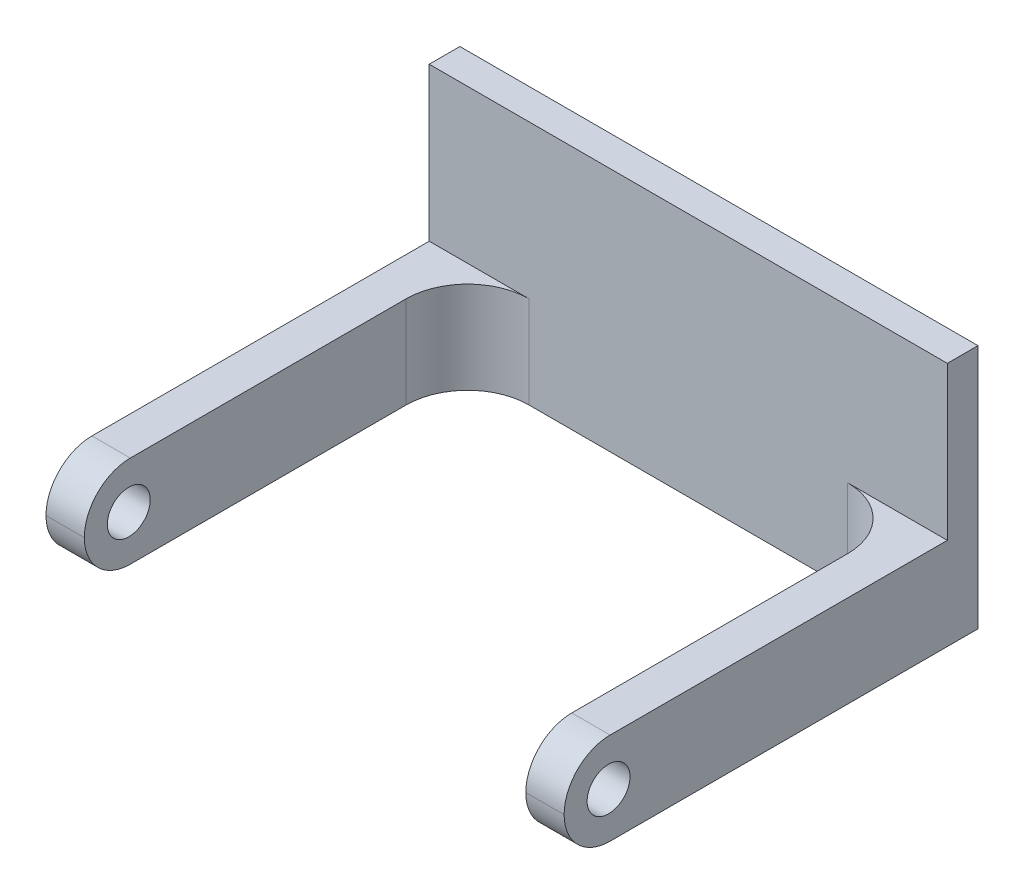
ISO-10303-21;
HEADER;
FILE_DESCRIPTION(('STEP AP214'),'2;1');
FILE_NAME('part.step','',(''),(''),'','','');
FILE_SCHEMA(('AUTOMOTIVE_DESIGN { 1 0 10303 214 1 1 1 1 }'));
ENDSEC;
DATA;
#1=APPLICATION_CONTEXT('core data for automotive mechanical design processes');
#2=APPLICATION_PROTOCOL_DEFINITION('international standard','automotive_design',2000,#1);
#3=PRODUCT_CONTEXT('',#1,'mechanical');
#4=PRODUCT('Part','Part','',(#3));
#5=PRODUCT_RELATED_PRODUCT_CATEGORY('part','',(#4));
#6=PRODUCT_DEFINITION_FORMATION('','',#4);
#7=PRODUCT_DEFINITION_CONTEXT('part definition',#1,'design');
#8=PRODUCT_DEFINITION('design','',#6,#7);
#9=PRODUCT_DEFINITION_SHAPE('','',#8);
#10=(LENGTH_UNIT() NAMED_UNIT(*) SI_UNIT(.MILLI.,.METRE.));
#11=(NAMED_UNIT(*) PLANE_ANGLE_UNIT() SI_UNIT($,.RADIAN.));
#12=(NAMED_UNIT(*) SI_UNIT($,.STERADIAN.) SOLID_ANGLE_UNIT());
#13=UNCERTAINTY_MEASURE_WITH_UNIT(LENGTH_MEASURE(1.E-05),#10,'distance_accuracy_value','');
#14=(GEOMETRIC_REPRESENTATION_CONTEXT(3) GLOBAL_UNCERTAINTY_ASSIGNED_CONTEXT((#13)) GLOBAL_UNIT_ASSIGNED_CONTEXT((#10,
#11,#12)) REPRESENTATION_CONTEXT('',''));
#15=CARTESIAN_POINT('',(0.,0.,0.));
#16=DIRECTION('',(0.,0.,1.));
#17=DIRECTION('',(1.,0.,0.));
#18=AXIS2_PLACEMENT_3D('',#15,#16,#17);
#19=CARTESIAN_POINT('',(-16.9,3.,2.));
#20=DIRECTION('',(0.,-1.,0.));
#21=DIRECTION('',(0.,0.,-1.));
#22=AXIS2_PLACEMENT_3D('',#19,#20,#21);
#23=PLANE('',#22);
#24=DIRECTION('',(1.,0.,0.));
#25=VECTOR('',#24,1.);
#26=CARTESIAN_POINT('',(-16.9,3.,2.));
#27=LINE('',#26,#25);
#28=CARTESIAN_POINT('',(-16.9,3.,2.));
#29=VERTEX_POINT('',#28);
#30=CARTESIAN_POINT('',(-10.4,3.,2.));
#31=VERTEX_POINT('',#30);
#32=EDGE_CURVE('E159',#29,#31,#27,.T.);
#33=ORIENTED_EDGE('',*,*,#32,.F.);
#34=DIRECTION('',(0.,0.,-1.));
#35=VECTOR('',#34,1.);
#36=CARTESIAN_POINT('',(-16.9,3.,2.));
#37=LINE('',#36,#35);
#38=CARTESIAN_POINT('',(-16.9,3.,24.));
#39=VERTEX_POINT('',#38);
#40=EDGE_CURVE('E165',#39,#29,#37,.T.);
#41=ORIENTED_EDGE('',*,*,#40,.F.);
#42=DIRECTION('',(-1.,0.,0.));
#43=VECTOR('',#42,1.);
#44=CARTESIAN_POINT('',(-14.4,3.,24.));
#45=LINE('',#44,#43);
#46=CARTESIAN_POINT('',(-14.4,3.,24.));
#47=VERTEX_POINT('',#46);
#48=EDGE_CURVE('E239',#39,#47,#45,.F.);
#49=ORIENTED_EDGE('',*,*,#48,.T.);
#50=DIRECTION('',(0.,0.,-1.));
#51=VECTOR('',#50,1.);
#52=CARTESIAN_POINT('',(-14.4,3.,27.));
#53=LINE('',#52,#51);
#54=CARTESIAN_POINT('',(-14.4,3.,6.));
#55=VERTEX_POINT('',#54);
#56=EDGE_CURVE('E210',#47,#55,#53,.T.);
#57=ORIENTED_EDGE('',*,*,#56,.T.);
#58=CARTESIAN_POINT('',(-10.4,3.,6.));
#59=DIRECTION('',(0.,-1.,0.));
#60=DIRECTION('',(0.,0.,-1.));
#61=AXIS2_PLACEMENT_3D('',#58,#59,#60);
#62=CIRCLE('',#61,4.);
#63=EDGE_CURVE('E43',#55,#31,#62,.T.);
#64=ORIENTED_EDGE('',*,*,#63,.T.);
#65=EDGE_LOOP('',(#33,#41,#49,#57,#64));
#66=FACE_BOUND('',#65,.T.);
#67=ADVANCED_FACE('F35',(#66),#23,.F.);
#68=CARTESIAN_POINT('',(10.4,3.,2.));
#69=VERTEX_POINT('',#68);
#70=CARTESIAN_POINT('',(16.9,3.,2.));
#71=VERTEX_POINT('',#70);
#72=EDGE_CURVE('E175',#69,#71,#27,.T.);
#73=ORIENTED_EDGE('',*,*,#72,.F.);
#74=CARTESIAN_POINT('',(10.4,3.,6.));
#75=DIRECTION('',(0.,-1.,0.));
#76=DIRECTION('',(0.,0.,-1.));
#77=AXIS2_PLACEMENT_3D('',#74,#75,#76);
#78=CIRCLE('',#77,4.);
#79=CARTESIAN_POINT('',(14.4,3.,6.));
#80=VERTEX_POINT('',#79);
#81=EDGE_CURVE('E324',#69,#80,#78,.T.);
#82=ORIENTED_EDGE('',*,*,#81,.T.);
#83=DIRECTION('',(0.,0.,-1.));
#84=VECTOR('',#83,1.);
#85=CARTESIAN_POINT('',(14.4,3.,27.));
#86=LINE('',#85,#84);
#87=CARTESIAN_POINT('',(14.4,3.,24.));
#88=VERTEX_POINT('',#87);
#89=EDGE_CURVE('E213',#88,#80,#86,.T.);
#90=ORIENTED_EDGE('',*,*,#89,.F.);
#91=DIRECTION('',(-1.,0.,0.));
#92=VECTOR('',#91,1.);
#93=CARTESIAN_POINT('',(-16.9,3.,24.));
#94=LINE('',#93,#92);
#95=CARTESIAN_POINT('',(16.9,3.,24.));
#96=VERTEX_POINT('',#95);
#97=EDGE_CURVE('E237',#88,#96,#94,.F.);
#98=ORIENTED_EDGE('',*,*,#97,.T.);
#99=DIRECTION('',(0.,0.,-1.));
#100=VECTOR('',#99,1.);
#101=CARTESIAN_POINT('',(16.9,3.,2.));
#102=LINE('',#101,#100);
#103=EDGE_CURVE('E202',#96,#71,#102,.T.);
#104=ORIENTED_EDGE('',*,*,#103,.T.);
#105=EDGE_LOOP('',(#73,#82,#90,#98,#104));
#106=FACE_BOUND('',#105,.T.);
#107=ADVANCED_FACE('F286',(#106),#23,.F.);
#108=CARTESIAN_POINT('',(0.,0.,2.));
#109=DIRECTION('',(0.,0.,-1.));
#110=DIRECTION('',(-1.,0.,0.));
#111=AXIS2_PLACEMENT_3D('',#108,#109,#110);
#112=PLANE('',#111);
#113=DIRECTION('',(1.,0.,0.));
#114=VECTOR('',#113,1.);
#115=CARTESIAN_POINT('',(-16.9,-3.,2.));
#116=LINE('',#115,#114);
#117=CARTESIAN_POINT('',(-10.4,-3.,2.));
#118=VERTEX_POINT('',#117);
#119=CARTESIAN_POINT('',(10.4,-3.,2.));
#120=VERTEX_POINT('',#119);
#121=EDGE_CURVE('E191',#118,#120,#116,.T.);
#122=ORIENTED_EDGE('',*,*,#121,.T.);
#123=DIRECTION('',(0.,-1.,0.));
#124=VECTOR('',#123,1.);
#125=CARTESIAN_POINT('',(10.4,3.,2.));
#126=LINE('',#125,#124);
#127=EDGE_CURVE('E326',#120,#69,#126,.F.);
#128=ORIENTED_EDGE('',*,*,#127,.T.);
#129=ORIENTED_EDGE('',*,*,#72,.T.);
#130=DIRECTION('',(0.,-1.,0.));
#131=VECTOR('',#130,1.);
#132=CARTESIAN_POINT('',(16.9,13.,2.));
#133=LINE('',#132,#131);
#134=CARTESIAN_POINT('',(16.9,13.,2.));
#135=VERTEX_POINT('',#134);
#136=EDGE_CURVE('E145',#135,#71,#133,.T.);
#137=ORIENTED_EDGE('',*,*,#136,.F.);
#138=DIRECTION('',(1.,0.,0.));
#139=VECTOR('',#138,1.);
#140=CARTESIAN_POINT('',(-16.9,13.,2.));
#141=LINE('',#140,#139);
#142=CARTESIAN_POINT('',(-16.9,13.,2.));
#143=VERTEX_POINT('',#142);
#144=EDGE_CURVE('E137',#143,#135,#141,.T.);
#145=ORIENTED_EDGE('',*,*,#144,.F.);
#146=DIRECTION('',(0.,-1.,0.));
#147=VECTOR('',#146,1.);
#148=CARTESIAN_POINT('',(-16.9,13.,2.));
#149=LINE('',#148,#147);
#150=EDGE_CURVE('E142',#143,#29,#149,.T.);
#151=ORIENTED_EDGE('',*,*,#150,.T.);
#152=ORIENTED_EDGE('',*,*,#32,.T.);
#153=DIRECTION('',(0.,1.,0.));
#154=VECTOR('',#153,1.);
#155=CARTESIAN_POINT('',(-10.4,-3.,2.));
#156=LINE('',#155,#154);
#157=EDGE_CURVE('E247',#31,#118,#156,.F.);
#158=ORIENTED_EDGE('',*,*,#157,.T.);
#159=EDGE_LOOP('',(#122,#128,#129,#137,#145,#151,#152,#158));
#160=FACE_BOUND('',#159,.T.);
#161=ADVANCED_FACE('F140',(#160),#112,.F.);
#162=CARTESIAN_POINT('',(16.9,-3.,2.));
#163=DIRECTION('',(-1.,0.,0.));
#164=DIRECTION('',(0.,0.,1.));
#165=AXIS2_PLACEMENT_3D('',#162,#163,#164);
#166=PLANE('',#165);
#167=CARTESIAN_POINT('',(16.9,0.,24.1));
#168=DIRECTION('',(1.,0.,0.));
#169=DIRECTION('',(0.,0.,-1.));
#170=AXIS2_PLACEMENT_3D('',#167,#168,#169);
#171=CIRCLE('',#170,1.4);
#172=CARTESIAN_POINT('',(16.9,0.,22.7));
#173=VERTEX_POINT('',#172);
#174=EDGE_CURVE('E243',#173,#173,#171,.T.);
#175=ORIENTED_EDGE('',*,*,#174,.F.);
#176=EDGE_LOOP('',(#175));
#177=FACE_BOUND('',#176,.T.);
#178=CARTESIAN_POINT('',(16.9,0.,24.));
#179=DIRECTION('',(-1.,0.,0.));
#180=DIRECTION('',(0.,0.,1.));
#181=AXIS2_PLACEMENT_3D('',#178,#179,#180);
#182=CIRCLE('',#181,3.);
#183=CARTESIAN_POINT('',(16.9,0.,27.));
#184=VERTEX_POINT('',#183);
#185=EDGE_CURVE('E229',#96,#184,#182,.F.);
#186=ORIENTED_EDGE('',*,*,#185,.T.);
#187=CARTESIAN_POINT('',(16.9,0.,24.));
#188=DIRECTION('',(-1.,0.,0.));
#189=DIRECTION('',(0.,0.,1.));
#190=AXIS2_PLACEMENT_3D('',#187,#188,#189);
#191=CIRCLE('',#190,3.);
#192=CARTESIAN_POINT('',(16.9,-3.,24.));
#193=VERTEX_POINT('',#192);
#194=EDGE_CURVE('E231',#184,#193,#191,.F.);
#195=ORIENTED_EDGE('',*,*,#194,.T.);
#196=DIRECTION('',(0.,0.,-1.));
#197=VECTOR('',#196,1.);
#198=CARTESIAN_POINT('',(16.9,-3.,2.));
#199=LINE('',#198,#197);
#200=CARTESIAN_POINT('',(16.9,-3.,0.));
#201=VERTEX_POINT('',#200);
#202=EDGE_CURVE('E197',#193,#201,#199,.T.);
#203=ORIENTED_EDGE('',*,*,#202,.T.);
#204=DIRECTION('',(0.,1.,0.));
#205=VECTOR('',#204,1.);
#206=CARTESIAN_POINT('',(16.9,-3.,0.));
#207=LINE('',#206,#205);
#208=CARTESIAN_POINT('',(16.9,13.,0.));
#209=VERTEX_POINT('',#208);
#210=EDGE_CURVE('E186',#201,#209,#207,.T.);
#211=ORIENTED_EDGE('',*,*,#210,.T.);
#212=DIRECTION('',(0.,0.,-1.));
#213=VECTOR('',#212,1.);
#214=CARTESIAN_POINT('',(16.9,13.,0.));
#215=LINE('',#214,#213);
#216=EDGE_CURVE('E149',#135,#209,#215,.T.);
#217=ORIENTED_EDGE('',*,*,#216,.F.);
#218=ORIENTED_EDGE('',*,*,#136,.T.);
#219=ORIENTED_EDGE('',*,*,#103,.F.);
#220=EDGE_LOOP('',(#186,#195,#203,#211,#217,#218,#219));
#221=FACE_BOUND('',#220,.T.);
#222=ADVANCED_FACE('F296',(#177,#221),#166,.F.);
#223=CARTESIAN_POINT('',(-16.9,-3.,2.));
#224=DIRECTION('',(1.,0.,0.));
#225=DIRECTION('',(0.,0.,-1.));
#226=AXIS2_PLACEMENT_3D('',#223,#224,#225);
#227=PLANE('',#226);
#228=CARTESIAN_POINT('',(-16.9,0.,24.1));
#229=DIRECTION('',(1.,0.,0.));
#230=DIRECTION('',(0.,0.,-1.));
#231=AXIS2_PLACEMENT_3D('',#228,#229,#230);
#232=CIRCLE('',#231,1.4);
#233=CARTESIAN_POINT('',(-16.9,0.,22.7));
#234=VERTEX_POINT('',#233);
#235=EDGE_CURVE('E261',#234,#234,#232,.T.);
#236=ORIENTED_EDGE('',*,*,#235,.T.);
#237=EDGE_LOOP('',(#236));
#238=FACE_BOUND('',#237,.T.);
#239=DIRECTION('',(0.,0.,-1.));
#240=VECTOR('',#239,1.);
#241=CARTESIAN_POINT('',(-16.9,-3.,2.));
#242=LINE('',#241,#240);
#243=CARTESIAN_POINT('',(-16.9,-3.,24.));
#244=VERTEX_POINT('',#243);
#245=CARTESIAN_POINT('',(-16.9,-3.,0.));
#246=VERTEX_POINT('',#245);
#247=EDGE_CURVE('E199',#244,#246,#242,.T.);
#248=ORIENTED_EDGE('',*,*,#247,.F.);
#249=CARTESIAN_POINT('',(-16.9,0.,24.));
#250=DIRECTION('',(1.,0.,0.));
#251=DIRECTION('',(0.,0.,-1.));
#252=AXIS2_PLACEMENT_3D('',#249,#250,#251);
#253=CIRCLE('',#252,3.);
#254=CARTESIAN_POINT('',(-16.9,0.,27.));
#255=VERTEX_POINT('',#254);
#256=EDGE_CURVE('E227',#244,#255,#253,.F.);
#257=ORIENTED_EDGE('',*,*,#256,.T.);
#258=CARTESIAN_POINT('',(-16.9,0.,24.));
#259=DIRECTION('',(1.,0.,0.));
#260=DIRECTION('',(0.,0.,-1.));
#261=AXIS2_PLACEMENT_3D('',#258,#259,#260);
#262=CIRCLE('',#261,3.);
#263=EDGE_CURVE('E225',#255,#39,#262,.F.);
#264=ORIENTED_EDGE('',*,*,#263,.T.);
#265=ORIENTED_EDGE('',*,*,#40,.T.);
#266=ORIENTED_EDGE('',*,*,#150,.F.);
#267=DIRECTION('',(0.,0.,1.));
#268=VECTOR('',#267,1.);
#269=CARTESIAN_POINT('',(-16.9,13.,0.));
#270=LINE('',#269,#268);
#271=CARTESIAN_POINT('',(-16.9,13.,0.));
#272=VERTEX_POINT('',#271);
#273=EDGE_CURVE('E150',#272,#143,#270,.T.);
#274=ORIENTED_EDGE('',*,*,#273,.F.);
#275=DIRECTION('',(0.,-1.,0.));
#276=VECTOR('',#275,1.);
#277=CARTESIAN_POINT('',(-16.9,-3.,0.));
#278=LINE('',#277,#276);
#279=EDGE_CURVE('E187',#272,#246,#278,.T.);
#280=ORIENTED_EDGE('',*,*,#279,.T.);
#281=EDGE_LOOP('',(#248,#257,#264,#265,#266,#274,#280));
#282=FACE_BOUND('',#281,.T.);
#283=ADVANCED_FACE('F163',(#238,#282),#227,.F.);
#284=CARTESIAN_POINT('',(-16.9,-3.,2.));
#285=DIRECTION('',(0.,1.,0.));
#286=DIRECTION('',(0.,0.,1.));
#287=AXIS2_PLACEMENT_3D('',#284,#285,#286);
#288=PLANE('',#287);
#289=DIRECTION('',(0.,0.,-1.));
#290=VECTOR('',#289,1.);
#291=CARTESIAN_POINT('',(-14.4,-3.,27.));
#292=LINE('',#291,#290);
#293=CARTESIAN_POINT('',(-14.4,-3.,24.));
#294=VERTEX_POINT('',#293);
#295=CARTESIAN_POINT('',(-14.4,-3.,6.));
#296=VERTEX_POINT('',#295);
#297=EDGE_CURVE('E193',#294,#296,#292,.T.);
#298=ORIENTED_EDGE('',*,*,#297,.F.);
#299=DIRECTION('',(1.,0.,0.));
#300=VECTOR('',#299,1.);
#301=CARTESIAN_POINT('',(-16.9,-3.,24.));
#302=LINE('',#301,#300);
#303=EDGE_CURVE('E222',#294,#244,#302,.F.);
#304=ORIENTED_EDGE('',*,*,#303,.T.);
#305=ORIENTED_EDGE('',*,*,#247,.T.);
#306=DIRECTION('',(1.,0.,0.));
#307=VECTOR('',#306,1.);
#308=CARTESIAN_POINT('',(-16.9,-3.,0.));
#309=LINE('',#308,#307);
#310=EDGE_CURVE('E189',#246,#201,#309,.T.);
#311=ORIENTED_EDGE('',*,*,#310,.T.);
#312=ORIENTED_EDGE('',*,*,#202,.F.);
#313=DIRECTION('',(1.,0.,0.));
#314=VECTOR('',#313,1.);
#315=CARTESIAN_POINT('',(-16.9,-3.,24.));
#316=LINE('',#315,#314);
#317=CARTESIAN_POINT('',(14.4,-3.,24.));
#318=VERTEX_POINT('',#317);
#319=EDGE_CURVE('E219',#193,#318,#316,.F.);
#320=ORIENTED_EDGE('',*,*,#319,.T.);
#321=DIRECTION('',(0.,0.,-1.));
#322=VECTOR('',#321,1.);
#323=CARTESIAN_POINT('',(14.4,-3.,27.));
#324=LINE('',#323,#322);
#325=CARTESIAN_POINT('',(14.4,-3.,6.));
#326=VERTEX_POINT('',#325);
#327=EDGE_CURVE('E254',#318,#326,#324,.T.);
#328=ORIENTED_EDGE('',*,*,#327,.T.);
#329=CARTESIAN_POINT('',(10.4,-3.,6.));
#330=DIRECTION('',(0.,1.,0.));
#331=DIRECTION('',(0.,0.,1.));
#332=AXIS2_PLACEMENT_3D('',#329,#330,#331);
#333=CIRCLE('',#332,4.);
#334=EDGE_CURVE('E328',#326,#120,#333,.T.);
#335=ORIENTED_EDGE('',*,*,#334,.T.);
#336=ORIENTED_EDGE('',*,*,#121,.F.);
#337=CARTESIAN_POINT('',(-10.4,-3.,6.));
#338=DIRECTION('',(0.,1.,0.));
#339=DIRECTION('',(0.,0.,1.));
#340=AXIS2_PLACEMENT_3D('',#337,#338,#339);
#341=CIRCLE('',#340,4.);
#342=EDGE_CURVE('E11',#118,#296,#341,.T.);
#343=ORIENTED_EDGE('',*,*,#342,.T.);
#344=EDGE_LOOP('',(#298,#304,#305,#311,#312,#320,#328,#335,#336,#343));
#345=FACE_BOUND('',#344,.T.);
#346=ADVANCED_FACE('F333',(#345),#288,.F.);
#347=CARTESIAN_POINT('',(0.,0.,0.));
#348=DIRECTION('',(0.,0.,-1.));
#349=DIRECTION('',(-1.,0.,0.));
#350=AXIS2_PLACEMENT_3D('',#347,#348,#349);
#351=PLANE('',#350);
#352=ORIENTED_EDGE('',*,*,#210,.F.);
#353=ORIENTED_EDGE('',*,*,#310,.F.);
#354=ORIENTED_EDGE('',*,*,#279,.F.);
#355=DIRECTION('',(-1.,0.,0.));
#356=VECTOR('',#355,1.);
#357=CARTESIAN_POINT('',(-16.9,13.,0.));
#358=LINE('',#357,#356);
#359=EDGE_CURVE('E156',#209,#272,#358,.T.);
#360=ORIENTED_EDGE('',*,*,#359,.F.);
#361=EDGE_LOOP('',(#352,#353,#354,#360));
#362=FACE_BOUND('',#361,.T.);
#363=ADVANCED_FACE('F184',(#362),#351,.T.);
#364=CARTESIAN_POINT('',(-14.4,3.,27.));
#365=DIRECTION('',(-1.,0.,0.));
#366=DIRECTION('',(0.,0.,1.));
#367=AXIS2_PLACEMENT_3D('',#364,#365,#366);
#368=PLANE('',#367);
#369=CARTESIAN_POINT('',(-14.4,0.,24.1));
#370=DIRECTION('',(-1.,0.,0.));
#371=DIRECTION('',(0.,0.,1.));
#372=AXIS2_PLACEMENT_3D('',#369,#370,#371);
#373=CIRCLE('',#372,1.4);
#374=CARTESIAN_POINT('',(-14.4,0.,25.5));
#375=VERTEX_POINT('',#374);
#376=EDGE_CURVE('E257',#375,#375,#373,.T.);
#377=ORIENTED_EDGE('',*,*,#376,.T.);
#378=EDGE_LOOP('',(#377));
#379=FACE_BOUND('',#378,.T.);
#380=ORIENTED_EDGE('',*,*,#297,.T.);
#381=DIRECTION('',(0.,1.,0.));
#382=VECTOR('',#381,1.);
#383=CARTESIAN_POINT('',(-14.4,3.,6.));
#384=LINE('',#383,#382);
#385=EDGE_CURVE('E330',#296,#55,#384,.T.);
#386=ORIENTED_EDGE('',*,*,#385,.T.);
#387=ORIENTED_EDGE('',*,*,#56,.F.);
#388=CARTESIAN_POINT('',(-14.4,0.,24.));
#389=DIRECTION('',(-1.,0.,0.));
#390=DIRECTION('',(0.,0.,1.));
#391=AXIS2_PLACEMENT_3D('',#388,#389,#390);
#392=CIRCLE('',#391,3.);
#393=CARTESIAN_POINT('',(-14.4,0.,27.));
#394=VERTEX_POINT('',#393);
#395=EDGE_CURVE('E204',#47,#394,#392,.F.);
#396=ORIENTED_EDGE('',*,*,#395,.T.);
#397=CARTESIAN_POINT('',(-14.4,0.,24.));
#398=DIRECTION('',(-1.,0.,0.));
#399=DIRECTION('',(0.,0.,1.));
#400=AXIS2_PLACEMENT_3D('',#397,#398,#399);
#401=CIRCLE('',#400,3.);
#402=EDGE_CURVE('E217',#394,#294,#401,.F.);
#403=ORIENTED_EDGE('',*,*,#402,.T.);
#404=EDGE_LOOP('',(#380,#386,#387,#396,#403));
#405=FACE_BOUND('',#404,.T.);
#406=ADVANCED_FACE('F282',(#379,#405),#368,.F.);
#407=CARTESIAN_POINT('',(14.4,3.,27.));
#408=DIRECTION('',(1.,0.,0.));
#409=DIRECTION('',(0.,0.,-1.));
#410=AXIS2_PLACEMENT_3D('',#407,#408,#409);
#411=PLANE('',#410);
#412=CARTESIAN_POINT('',(14.4,0.,24.1));
#413=DIRECTION('',(1.,0.,0.));
#414=DIRECTION('',(0.,0.,-1.));
#415=AXIS2_PLACEMENT_3D('',#412,#413,#414);
#416=CIRCLE('',#415,1.4);
#417=CARTESIAN_POINT('',(14.4,0.,22.7));
#418=VERTEX_POINT('',#417);
#419=EDGE_CURVE('E214',#418,#418,#416,.T.);
#420=ORIENTED_EDGE('',*,*,#419,.T.);
#421=EDGE_LOOP('',(#420));
#422=FACE_BOUND('',#421,.T.);
#423=ORIENTED_EDGE('',*,*,#89,.T.);
#424=DIRECTION('',(0.,-1.,0.));
#425=VECTOR('',#424,1.);
#426=CARTESIAN_POINT('',(14.4,-3.,6.));
#427=LINE('',#426,#425);
#428=EDGE_CURVE('E241',#80,#326,#427,.T.);
#429=ORIENTED_EDGE('',*,*,#428,.T.);
#430=ORIENTED_EDGE('',*,*,#327,.F.);
#431=CARTESIAN_POINT('',(14.4,0.,24.));
#432=DIRECTION('',(1.,0.,0.));
#433=DIRECTION('',(0.,0.,-1.));
#434=AXIS2_PLACEMENT_3D('',#431,#432,#433);
#435=CIRCLE('',#434,3.);
#436=CARTESIAN_POINT('',(14.4,0.,27.));
#437=VERTEX_POINT('',#436);
#438=EDGE_CURVE('E235',#318,#437,#435,.F.);
#439=ORIENTED_EDGE('',*,*,#438,.T.);
#440=CARTESIAN_POINT('',(14.4,0.,24.));
#441=DIRECTION('',(1.,0.,0.));
#442=DIRECTION('',(0.,0.,-1.));
#443=AXIS2_PLACEMENT_3D('',#440,#441,#442);
#444=CIRCLE('',#443,3.);
#445=EDGE_CURVE('E233',#437,#88,#444,.F.);
#446=ORIENTED_EDGE('',*,*,#445,.T.);
#447=EDGE_LOOP('',(#423,#429,#430,#439,#446));
#448=FACE_BOUND('',#447,.T.);
#449=ADVANCED_FACE('F268',(#422,#448),#411,.F.);
#450=CARTESIAN_POINT('',(-16.9,0.,24.1));
#451=DIRECTION('',(1.,0.,0.));
#452=DIRECTION('',(0.,0.,-1.));
#453=AXIS2_PLACEMENT_3D('',#450,#451,#452);
#454=CYLINDRICAL_SURFACE('',#453,1.4);
#455=ORIENTED_EDGE('',*,*,#174,.T.);
#456=EDGE_LOOP('',(#455));
#457=FACE_BOUND('',#456,.T.);
#458=ORIENTED_EDGE('',*,*,#419,.F.);
#459=EDGE_LOOP('',(#458));
#460=FACE_BOUND('',#459,.T.);
#461=ADVANCED_FACE('F271',(#457,#460),#454,.F.);
#462=ORIENTED_EDGE('',*,*,#235,.F.);
#463=EDGE_LOOP('',(#462));
#464=FACE_BOUND('',#463,.T.);
#465=ORIENTED_EDGE('',*,*,#376,.F.);
#466=EDGE_LOOP('',(#465));
#467=FACE_BOUND('',#466,.T.);
#468=ADVANCED_FACE('F273',(#464,#467),#454,.F.);
#469=CARTESIAN_POINT('',(0.,0.,24.));
#470=DIRECTION('',(1.,0.,0.));
#471=DIRECTION('',(0.,0.,-1.));
#472=AXIS2_PLACEMENT_3D('',#469,#470,#471);
#473=CYLINDRICAL_SURFACE('',#472,3.);
#474=ORIENTED_EDGE('',*,*,#48,.F.);
#475=ORIENTED_EDGE('',*,*,#263,.F.);
#476=DIRECTION('',(-1.,0.,0.));
#477=VECTOR('',#476,1.);
#478=CARTESIAN_POINT('',(-16.9,0.,27.));
#479=LINE('',#478,#477);
#480=EDGE_CURVE('E169',#394,#255,#479,.T.);
#481=ORIENTED_EDGE('',*,*,#480,.F.);
#482=ORIENTED_EDGE('',*,*,#395,.F.);
#483=EDGE_LOOP('',(#474,#475,#481,#482));
#484=FACE_BOUND('',#483,.T.);
#485=ADVANCED_FACE('F280',(#484),#473,.T.);
#486=CARTESIAN_POINT('',(0.,0.,24.));
#487=DIRECTION('',(-1.,0.,0.));
#488=DIRECTION('',(0.,0.,1.));
#489=AXIS2_PLACEMENT_3D('',#486,#487,#488);
#490=CYLINDRICAL_SURFACE('',#489,3.);
#491=ORIENTED_EDGE('',*,*,#256,.F.);
#492=ORIENTED_EDGE('',*,*,#303,.F.);
#493=ORIENTED_EDGE('',*,*,#402,.F.);
#494=ORIENTED_EDGE('',*,*,#480,.T.);
#495=EDGE_LOOP('',(#491,#492,#493,#494));
#496=FACE_BOUND('',#495,.T.);
#497=ADVANCED_FACE('F300',(#496),#490,.T.);
#498=CARTESIAN_POINT('',(0.,0.,24.));
#499=DIRECTION('',(-1.,0.,0.));
#500=DIRECTION('',(0.,0.,1.));
#501=AXIS2_PLACEMENT_3D('',#498,#499,#500);
#502=CYLINDRICAL_SURFACE('',#501,3.);
#503=ORIENTED_EDGE('',*,*,#97,.F.);
#504=ORIENTED_EDGE('',*,*,#445,.F.);
#505=DIRECTION('',(-1.,0.,0.));
#506=VECTOR('',#505,1.);
#507=CARTESIAN_POINT('',(0.,0.,27.));
#508=LINE('',#507,#506);
#509=EDGE_CURVE('E166',#184,#437,#508,.T.);
#510=ORIENTED_EDGE('',*,*,#509,.F.);
#511=ORIENTED_EDGE('',*,*,#185,.F.);
#512=EDGE_LOOP('',(#503,#504,#510,#511));
#513=FACE_BOUND('',#512,.T.);
#514=ADVANCED_FACE('F303',(#513),#502,.T.);
#515=CARTESIAN_POINT('',(0.,0.,24.));
#516=DIRECTION('',(1.,0.,0.));
#517=DIRECTION('',(0.,0.,-1.));
#518=AXIS2_PLACEMENT_3D('',#515,#516,#517);
#519=CYLINDRICAL_SURFACE('',#518,3.);
#520=ORIENTED_EDGE('',*,*,#438,.F.);
#521=ORIENTED_EDGE('',*,*,#319,.F.);
#522=ORIENTED_EDGE('',*,*,#194,.F.);
#523=ORIENTED_EDGE('',*,*,#509,.T.);
#524=EDGE_LOOP('',(#520,#521,#522,#523));
#525=FACE_BOUND('',#524,.T.);
#526=ADVANCED_FACE('F308',(#525),#519,.T.);
#527=CARTESIAN_POINT('',(0.,13.,0.));
#528=DIRECTION('',(0.,1.,0.));
#529=DIRECTION('',(0.,0.,1.));
#530=AXIS2_PLACEMENT_3D('',#527,#528,#529);
#531=PLANE('',#530);
#532=ORIENTED_EDGE('',*,*,#273,.T.);
#533=ORIENTED_EDGE('',*,*,#144,.T.);
#534=ORIENTED_EDGE('',*,*,#216,.T.);
#535=ORIENTED_EDGE('',*,*,#359,.T.);
#536=EDGE_LOOP('',(#532,#533,#534,#535));
#537=FACE_BOUND('',#536,.T.);
#538=ADVANCED_FACE('F154',(#537),#531,.T.);
#539=CARTESIAN_POINT('',(10.4,3.,6.));
#540=DIRECTION('',(0.,1.,0.));
#541=DIRECTION('',(0.,0.,1.));
#542=AXIS2_PLACEMENT_3D('',#539,#540,#541);
#543=CYLINDRICAL_SURFACE('',#542,4.);
#544=ORIENTED_EDGE('',*,*,#81,.F.);
#545=ORIENTED_EDGE('',*,*,#127,.F.);
#546=ORIENTED_EDGE('',*,*,#334,.F.);
#547=ORIENTED_EDGE('',*,*,#428,.F.);
#548=EDGE_LOOP('',(#544,#545,#546,#547));
#549=FACE_BOUND('',#548,.T.);
#550=ADVANCED_FACE('F314',(#549),#543,.F.);
#551=CARTESIAN_POINT('',(-10.4,3.,6.));
#552=DIRECTION('',(0.,-1.,0.));
#553=DIRECTION('',(0.,0.,-1.));
#554=AXIS2_PLACEMENT_3D('',#551,#552,#553);
#555=CYLINDRICAL_SURFACE('',#554,4.);
#556=ORIENTED_EDGE('',*,*,#342,.F.);
#557=ORIENTED_EDGE('',*,*,#157,.F.);
#558=ORIENTED_EDGE('',*,*,#63,.F.);
#559=ORIENTED_EDGE('',*,*,#385,.F.);
#560=EDGE_LOOP('',(#556,#557,#558,#559));
#561=FACE_BOUND('',#560,.T.);
#562=ADVANCED_FACE('F37',(#561),#555,.F.);
#563=CLOSED_SHELL('',(#67,#107,#161,#222,#283,#346,#363,#406,#449,#461,#468,#485,#497,#514,#526,
#538,#550,#562));
#564=MANIFOLD_SOLID_BREP('B2',#563);
#565=ADVANCED_BREP_SHAPE_REPRESENTATION('',(#18,#564),#14);
#566=SHAPE_DEFINITION_REPRESENTATION(#9,#565);
ENDSEC;
END-ISO-10303-21;
